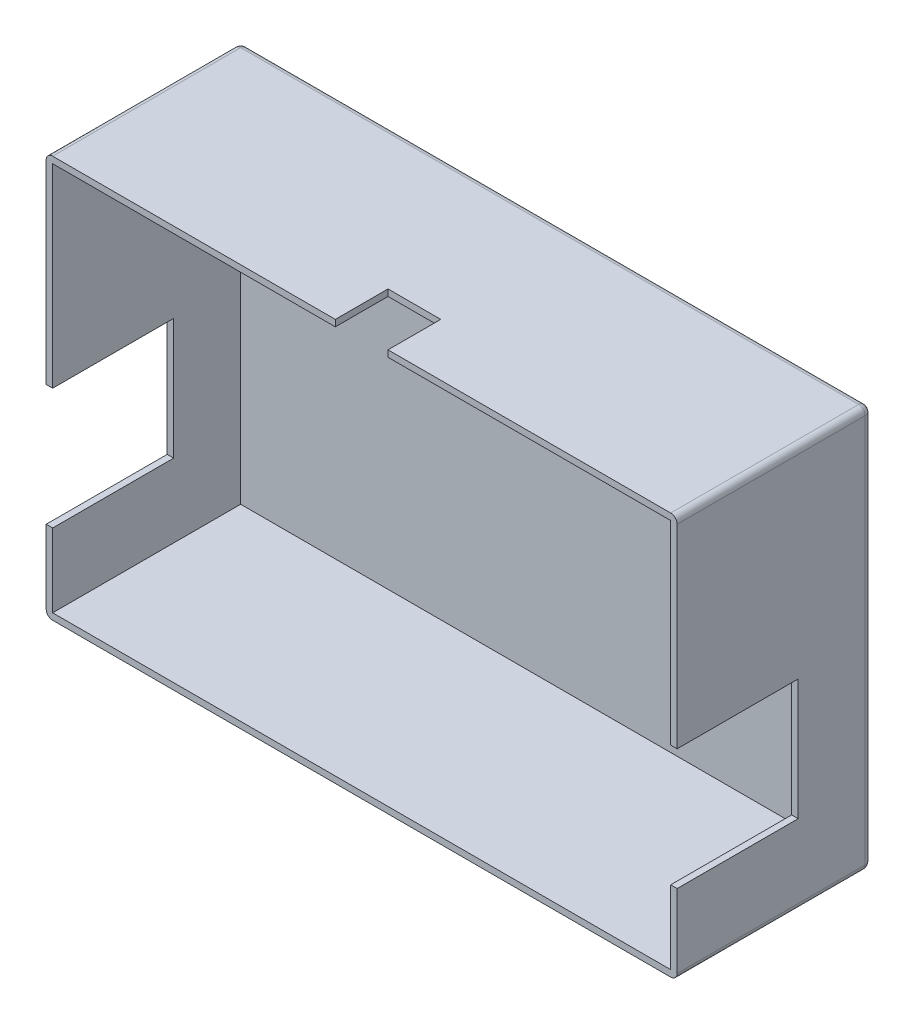
ISO-10303-21;
HEADER;
FILE_DESCRIPTION(('STEP AP214'),'2;1');
FILE_NAME('part.step','',(''),(''),'','','');
FILE_SCHEMA(('AUTOMOTIVE_DESIGN { 1 0 10303 214 1 1 1 1 }'));
ENDSEC;
DATA;
#1=APPLICATION_CONTEXT('core data for automotive mechanical design processes');
#2=APPLICATION_PROTOCOL_DEFINITION('international standard','automotive_design',2000,#1);
#3=PRODUCT_CONTEXT('',#1,'mechanical');
#4=PRODUCT('Part','Part','',(#3));
#5=PRODUCT_RELATED_PRODUCT_CATEGORY('part','',(#4));
#6=PRODUCT_DEFINITION_FORMATION('','',#4);
#7=PRODUCT_DEFINITION_CONTEXT('part definition',#1,'design');
#8=PRODUCT_DEFINITION('design','',#6,#7);
#9=PRODUCT_DEFINITION_SHAPE('','',#8);
#10=(LENGTH_UNIT() NAMED_UNIT(*) SI_UNIT(.MILLI.,.METRE.));
#11=(NAMED_UNIT(*) PLANE_ANGLE_UNIT() SI_UNIT($,.RADIAN.));
#12=(NAMED_UNIT(*) SI_UNIT($,.STERADIAN.) SOLID_ANGLE_UNIT());
#13=UNCERTAINTY_MEASURE_WITH_UNIT(LENGTH_MEASURE(1.E-05),#10,'distance_accuracy_value','');
#14=(GEOMETRIC_REPRESENTATION_CONTEXT(3) GLOBAL_UNCERTAINTY_ASSIGNED_CONTEXT((#13)) GLOBAL_UNIT_ASSIGNED_CONTEXT((#10,
#11,#12)) REPRESENTATION_CONTEXT('',''));
#15=CARTESIAN_POINT('',(0.,0.,0.));
#16=DIRECTION('',(0.,0.,1.));
#17=DIRECTION('',(1.,0.,0.));
#18=AXIS2_PLACEMENT_3D('',#15,#16,#17);
#19=CARTESIAN_POINT('',(-73.,93.,22.5));
#20=DIRECTION('',(0.,0.,-1.));
#21=DIRECTION('',(-1.,0.,0.));
#22=AXIS2_PLACEMENT_3D('',#19,#20,#21);
#23=PLANE('',#22);
#24=DIRECTION('',(0.,-1.,0.));
#25=VECTOR('',#24,1.);
#26=CARTESIAN_POINT('',(73.,93.,22.5));
#27=LINE('',#26,#25);
#28=CARTESIAN_POINT('',(73.,91.5,22.5));
#29=VERTEX_POINT('',#28);
#30=CARTESIAN_POINT('',(73.,46.5,22.5));
#31=VERTEX_POINT('',#30);
#32=EDGE_CURVE('E268',#29,#31,#27,.T.);
#33=ORIENTED_EDGE('',*,*,#32,.F.);
#34=CARTESIAN_POINT('',(71.5,91.5,22.5));
#35=DIRECTION('',(0.,0.,-1.));
#36=DIRECTION('',(-1.,0.,0.));
#37=AXIS2_PLACEMENT_3D('',#34,#35,#36);
#38=CIRCLE('',#37,1.5);
#39=CARTESIAN_POINT('',(71.5,93.,22.5));
#40=VERTEX_POINT('',#39);
#41=EDGE_CURVE('E48',#29,#40,#38,.F.);
#42=ORIENTED_EDGE('',*,*,#41,.T.);
#43=DIRECTION('',(1.,0.,0.));
#44=VECTOR('',#43,1.);
#45=CARTESIAN_POINT('',(-73.,93.,22.5));
#46=LINE('',#45,#44);
#47=CARTESIAN_POINT('',(6.09999999999999,93.,22.5));
#48=VERTEX_POINT('',#47);
#49=EDGE_CURVE('E264',#48,#40,#46,.T.);
#50=ORIENTED_EDGE('',*,*,#49,.F.);
#51=DIRECTION('',(0.,1.,0.));
#52=VECTOR('',#51,1.);
#53=CARTESIAN_POINT('',(6.09999999999999,91.5,22.5));
#54=LINE('',#53,#52);
#55=CARTESIAN_POINT('',(6.09999999999999,91.5,22.5));
#56=VERTEX_POINT('',#55);
#57=EDGE_CURVE('E380',#56,#48,#54,.T.);
#58=ORIENTED_EDGE('',*,*,#57,.F.);
#59=DIRECTION('',(1.,0.,0.));
#60=VECTOR('',#59,1.);
#61=CARTESIAN_POINT('',(0.,91.5,22.5));
#62=LINE('',#61,#60);
#63=CARTESIAN_POINT('',(71.5,91.5,22.5));
#64=VERTEX_POINT('',#63);
#65=EDGE_CURVE('E248',#56,#64,#62,.T.);
#66=ORIENTED_EDGE('',*,*,#65,.T.);
#67=DIRECTION('',(0.,-1.,0.));
#68=VECTOR('',#67,1.);
#69=CARTESIAN_POINT('',(71.5,93.,22.5));
#70=LINE('',#69,#68);
#71=CARTESIAN_POINT('',(71.5,46.5,22.5));
#72=VERTEX_POINT('',#71);
#73=EDGE_CURVE('E242',#64,#72,#70,.T.);
#74=ORIENTED_EDGE('',*,*,#73,.T.);
#75=DIRECTION('',(1.,0.,0.));
#76=VECTOR('',#75,1.);
#77=CARTESIAN_POINT('',(71.5,46.5,22.5));
#78=LINE('',#77,#76);
#79=EDGE_CURVE('E355',#72,#31,#78,.T.);
#80=ORIENTED_EDGE('',*,*,#79,.T.);
#81=EDGE_LOOP('',(#33,#42,#50,#58,#66,#74,#80));
#82=FACE_BOUND('',#81,.T.);
#83=ADVANCED_FACE('F39',(#82),#23,.F.);
#84=DIRECTION('',(1.,0.,0.));
#85=VECTOR('',#84,1.);
#86=CARTESIAN_POINT('',(-73.,0.,22.5));
#87=LINE('',#86,#85);
#88=CARTESIAN_POINT('',(-71.5,0.,22.5));
#89=VERTEX_POINT('',#88);
#90=CARTESIAN_POINT('',(71.5,0.,22.5));
#91=VERTEX_POINT('',#90);
#92=EDGE_CURVE('E265',#89,#91,#87,.T.);
#93=ORIENTED_EDGE('',*,*,#92,.T.);
#94=CARTESIAN_POINT('',(71.5,1.5,22.5));
#95=DIRECTION('',(0.,0.,-1.));
#96=DIRECTION('',(-1.,0.,0.));
#97=AXIS2_PLACEMENT_3D('',#94,#95,#96);
#98=CIRCLE('',#97,1.5);
#99=CARTESIAN_POINT('',(73.,1.50000000000003,22.5));
#100=VERTEX_POINT('',#99);
#101=EDGE_CURVE('E307',#91,#100,#98,.F.);
#102=ORIENTED_EDGE('',*,*,#101,.T.);
#103=CARTESIAN_POINT('',(73.,18.5,22.5));
#104=VERTEX_POINT('',#103);
#105=EDGE_CURVE('E234',#104,#100,#27,.T.);
#106=ORIENTED_EDGE('',*,*,#105,.F.);
#107=DIRECTION('',(1.,0.,0.));
#108=VECTOR('',#107,1.);
#109=CARTESIAN_POINT('',(71.5,18.5,22.5));
#110=LINE('',#109,#108);
#111=CARTESIAN_POINT('',(71.5,18.5,22.5));
#112=VERTEX_POINT('',#111);
#113=EDGE_CURVE('E216',#112,#104,#110,.T.);
#114=ORIENTED_EDGE('',*,*,#113,.F.);
#115=CARTESIAN_POINT('',(71.5,1.5,22.5));
#116=VERTEX_POINT('',#115);
#117=EDGE_CURVE('E231',#112,#116,#70,.T.);
#118=ORIENTED_EDGE('',*,*,#117,.T.);
#119=DIRECTION('',(1.,0.,0.));
#120=VECTOR('',#119,1.);
#121=CARTESIAN_POINT('',(0.,1.5,22.5));
#122=LINE('',#121,#120);
#123=CARTESIAN_POINT('',(-71.5,1.5,22.5));
#124=VERTEX_POINT('',#123);
#125=EDGE_CURVE('E258',#124,#116,#122,.T.);
#126=ORIENTED_EDGE('',*,*,#125,.F.);
#127=DIRECTION('',(0.,-1.,0.));
#128=VECTOR('',#127,1.);
#129=CARTESIAN_POINT('',(-71.5,93.,22.5));
#130=LINE('',#129,#128);
#131=CARTESIAN_POINT('',(-71.5,18.5,22.5));
#132=VERTEX_POINT('',#131);
#133=EDGE_CURVE('E246',#132,#124,#130,.T.);
#134=ORIENTED_EDGE('',*,*,#133,.F.);
#135=DIRECTION('',(-1.,0.,0.));
#136=VECTOR('',#135,1.);
#137=CARTESIAN_POINT('',(-71.5,18.5,22.5));
#138=LINE('',#137,#136);
#139=CARTESIAN_POINT('',(-73.,18.5,22.5));
#140=VERTEX_POINT('',#139);
#141=EDGE_CURVE('E406',#132,#140,#138,.T.);
#142=ORIENTED_EDGE('',*,*,#141,.T.);
#143=DIRECTION('',(0.,-1.,0.));
#144=VECTOR('',#143,1.);
#145=CARTESIAN_POINT('',(-73.,93.,22.5));
#146=LINE('',#145,#144);
#147=CARTESIAN_POINT('',(-73.,1.50000000000003,22.5));
#148=VERTEX_POINT('',#147);
#149=EDGE_CURVE('E270',#140,#148,#146,.T.);
#150=ORIENTED_EDGE('',*,*,#149,.T.);
#151=CARTESIAN_POINT('',(-71.5,1.5,22.5));
#152=DIRECTION('',(0.,0.,-1.));
#153=DIRECTION('',(-1.,0.,0.));
#154=AXIS2_PLACEMENT_3D('',#151,#152,#153);
#155=CIRCLE('',#154,1.5);
#156=EDGE_CURVE('E305',#148,#89,#155,.F.);
#157=ORIENTED_EDGE('',*,*,#156,.T.);
#158=EDGE_LOOP('',(#93,#102,#106,#114,#118,#126,#134,#142,#150,#157));
#159=FACE_BOUND('',#158,.T.);
#160=ADVANCED_FACE('F229',(#159),#23,.F.);
#161=CARTESIAN_POINT('',(73.,93.,22.5));
#162=DIRECTION('',(-1.,0.,0.));
#163=DIRECTION('',(0.,0.,1.));
#164=AXIS2_PLACEMENT_3D('',#161,#162,#163);
#165=PLANE('',#164);
#166=ORIENTED_EDGE('',*,*,#105,.T.);
#167=DIRECTION('',(0.,0.,-1.));
#168=VECTOR('',#167,1.);
#169=CARTESIAN_POINT('',(73.,1.5,-22.5));
#170=LINE('',#169,#168);
#171=CARTESIAN_POINT('',(73.,1.5,-21.));
#172=VERTEX_POINT('',#171);
#173=EDGE_CURVE('E287',#100,#172,#170,.T.);
#174=ORIENTED_EDGE('',*,*,#173,.T.);
#175=DIRECTION('',(0.,-1.,0.));
#176=VECTOR('',#175,1.);
#177=CARTESIAN_POINT('',(73.,93.,-21.));
#178=LINE('',#177,#176);
#179=CARTESIAN_POINT('',(73.,91.5,-21.));
#180=VERTEX_POINT('',#179);
#181=EDGE_CURVE('E284',#172,#180,#178,.F.);
#182=ORIENTED_EDGE('',*,*,#181,.T.);
#183=DIRECTION('',(0.,0.,-1.));
#184=VECTOR('',#183,1.);
#185=CARTESIAN_POINT('',(73.,91.5,22.5));
#186=LINE('',#185,#184);
#187=EDGE_CURVE('E282',#180,#29,#186,.F.);
#188=ORIENTED_EDGE('',*,*,#187,.T.);
#189=ORIENTED_EDGE('',*,*,#32,.T.);
#190=DIRECTION('',(0.,0.,-1.));
#191=VECTOR('',#190,1.);
#192=CARTESIAN_POINT('',(73.,46.5,22.5));
#193=LINE('',#192,#191);
#194=CARTESIAN_POINT('',(73.,46.5,-5.5));
#195=VERTEX_POINT('',#194);
#196=EDGE_CURVE('E224',#31,#195,#193,.T.);
#197=ORIENTED_EDGE('',*,*,#196,.T.);
#198=DIRECTION('',(0.,-1.,0.));
#199=VECTOR('',#198,1.);
#200=CARTESIAN_POINT('',(73.,46.5,-5.5));
#201=LINE('',#200,#199);
#202=CARTESIAN_POINT('',(73.,18.5,-5.5));
#203=VERTEX_POINT('',#202);
#204=EDGE_CURVE('E345',#195,#203,#201,.T.);
#205=ORIENTED_EDGE('',*,*,#204,.T.);
#206=DIRECTION('',(0.,0.,1.));
#207=VECTOR('',#206,1.);
#208=CARTESIAN_POINT('',(73.,18.5,-5.5));
#209=LINE('',#208,#207);
#210=EDGE_CURVE('E343',#203,#104,#209,.T.);
#211=ORIENTED_EDGE('',*,*,#210,.T.);
#212=EDGE_LOOP('',(#166,#174,#182,#188,#189,#197,#205,#211));
#213=FACE_BOUND('',#212,.T.);
#214=ADVANCED_FACE('F467',(#213),#165,.F.);
#215=CARTESIAN_POINT('',(71.5,93.,22.5));
#216=DIRECTION('',(-1.,0.,0.));
#217=DIRECTION('',(0.,0.,1.));
#218=AXIS2_PLACEMENT_3D('',#215,#216,#217);
#219=PLANE('',#218);
#220=DIRECTION('',(0.,-1.,0.));
#221=VECTOR('',#220,1.);
#222=CARTESIAN_POINT('',(71.5,46.5,-5.5));
#223=LINE('',#222,#221);
#224=CARTESIAN_POINT('',(71.5,46.5,-5.5));
#225=VERTEX_POINT('',#224);
#226=CARTESIAN_POINT('',(71.5,18.5,-5.5));
#227=VERTEX_POINT('',#226);
#228=EDGE_CURVE('E223',#225,#227,#223,.T.);
#229=ORIENTED_EDGE('',*,*,#228,.F.);
#230=DIRECTION('',(0.,0.,-1.));
#231=VECTOR('',#230,1.);
#232=CARTESIAN_POINT('',(71.5,46.5,22.5));
#233=LINE('',#232,#231);
#234=EDGE_CURVE('E235',#72,#225,#233,.T.);
#235=ORIENTED_EDGE('',*,*,#234,.F.);
#236=ORIENTED_EDGE('',*,*,#73,.F.);
#237=DIRECTION('',(0.,0.,-1.));
#238=VECTOR('',#237,1.);
#239=CARTESIAN_POINT('',(71.5,91.5,0.));
#240=LINE('',#239,#238);
#241=CARTESIAN_POINT('',(71.5,91.5,-21.));
#242=VERTEX_POINT('',#241);
#243=EDGE_CURVE('E260',#64,#242,#240,.T.);
#244=ORIENTED_EDGE('',*,*,#243,.T.);
#245=DIRECTION('',(0.,-1.,0.));
#246=VECTOR('',#245,1.);
#247=CARTESIAN_POINT('',(71.5,93.,-21.));
#248=LINE('',#247,#246);
#249=CARTESIAN_POINT('',(71.5,1.5,-21.));
#250=VERTEX_POINT('',#249);
#251=EDGE_CURVE('E267',#242,#250,#248,.T.);
#252=ORIENTED_EDGE('',*,*,#251,.T.);
#253=DIRECTION('',(0.,0.,-1.));
#254=VECTOR('',#253,1.);
#255=CARTESIAN_POINT('',(71.5,1.5,0.));
#256=LINE('',#255,#254);
#257=EDGE_CURVE('E241',#116,#250,#256,.T.);
#258=ORIENTED_EDGE('',*,*,#257,.F.);
#259=ORIENTED_EDGE('',*,*,#117,.F.);
#260=DIRECTION('',(0.,0.,1.));
#261=VECTOR('',#260,1.);
#262=CARTESIAN_POINT('',(71.5,18.5,-5.5));
#263=LINE('',#262,#261);
#264=EDGE_CURVE('E212',#227,#112,#263,.T.);
#265=ORIENTED_EDGE('',*,*,#264,.F.);
#266=EDGE_LOOP('',(#229,#235,#236,#244,#252,#258,#259,#265));
#267=FACE_BOUND('',#266,.T.);
#268=ADVANCED_FACE('F238',(#267),#219,.T.);
#269=CARTESIAN_POINT('',(-71.5,93.,22.5));
#270=VERTEX_POINT('',#269);
#271=CARTESIAN_POINT('',(-6.10000000000001,93.,22.5));
#272=VERTEX_POINT('',#271);
#273=EDGE_CURVE('E262',#270,#272,#46,.T.);
#274=ORIENTED_EDGE('',*,*,#273,.F.);
#275=CARTESIAN_POINT('',(-71.5,91.5,22.5));
#276=DIRECTION('',(0.,0.,-1.));
#277=DIRECTION('',(-1.,0.,0.));
#278=AXIS2_PLACEMENT_3D('',#275,#276,#277);
#279=CIRCLE('',#278,1.5);
#280=CARTESIAN_POINT('',(-73.,91.5,22.5));
#281=VERTEX_POINT('',#280);
#282=EDGE_CURVE('E11',#270,#281,#279,.F.);
#283=ORIENTED_EDGE('',*,*,#282,.T.);
#284=CARTESIAN_POINT('',(-73.,46.5,22.5));
#285=VERTEX_POINT('',#284);
#286=EDGE_CURVE('E271',#281,#285,#146,.T.);
#287=ORIENTED_EDGE('',*,*,#286,.T.);
#288=DIRECTION('',(-1.,0.,0.));
#289=VECTOR('',#288,1.);
#290=CARTESIAN_POINT('',(-71.5,46.5,22.5));
#291=LINE('',#290,#289);
#292=CARTESIAN_POINT('',(-71.5,46.5,22.5));
#293=VERTEX_POINT('',#292);
#294=EDGE_CURVE('E399',#293,#285,#291,.T.);
#295=ORIENTED_EDGE('',*,*,#294,.F.);
#296=CARTESIAN_POINT('',(-71.5,91.5,22.5));
#297=VERTEX_POINT('',#296);
#298=EDGE_CURVE('E254',#297,#293,#130,.T.);
#299=ORIENTED_EDGE('',*,*,#298,.F.);
#300=CARTESIAN_POINT('',(-6.10000000000001,91.5,22.5));
#301=VERTEX_POINT('',#300);
#302=EDGE_CURVE('E243',#297,#301,#62,.T.);
#303=ORIENTED_EDGE('',*,*,#302,.T.);
#304=DIRECTION('',(0.,1.,0.));
#305=VECTOR('',#304,1.);
#306=CARTESIAN_POINT('',(-6.10000000000001,91.5,22.5));
#307=LINE('',#306,#305);
#308=EDGE_CURVE('E383',#301,#272,#307,.T.);
#309=ORIENTED_EDGE('',*,*,#308,.T.);
#310=EDGE_LOOP('',(#274,#283,#287,#295,#299,#303,#309));
#311=FACE_BOUND('',#310,.T.);
#312=ADVANCED_FACE('F500',(#311),#23,.F.);
#313=CARTESIAN_POINT('',(-73.,93.,-22.5));
#314=DIRECTION('',(0.,0.,1.));
#315=DIRECTION('',(1.,0.,0.));
#316=AXIS2_PLACEMENT_3D('',#313,#314,#315);
#317=PLANE('',#316);
#318=DIRECTION('',(-1.,0.,0.));
#319=VECTOR('',#318,1.);
#320=CARTESIAN_POINT('',(-73.,91.5,-22.5));
#321=LINE('',#320,#319);
#322=CARTESIAN_POINT('',(-71.5,91.5,-22.5));
#323=VERTEX_POINT('',#322);
#324=CARTESIAN_POINT('',(71.5,91.5,-22.5));
#325=VERTEX_POINT('',#324);
#326=EDGE_CURVE('E277',#323,#325,#321,.F.);
#327=ORIENTED_EDGE('',*,*,#326,.T.);
#328=DIRECTION('',(0.,-1.,0.));
#329=VECTOR('',#328,1.);
#330=CARTESIAN_POINT('',(71.5,93.,-22.5));
#331=LINE('',#330,#329);
#332=CARTESIAN_POINT('',(71.5,1.5,-22.5));
#333=VERTEX_POINT('',#332);
#334=EDGE_CURVE('E279',#325,#333,#331,.T.);
#335=ORIENTED_EDGE('',*,*,#334,.T.);
#336=DIRECTION('',(-1.,0.,0.));
#337=VECTOR('',#336,1.);
#338=CARTESIAN_POINT('',(-73.,1.5,-22.5));
#339=LINE('',#338,#337);
#340=CARTESIAN_POINT('',(-71.5,1.5,-22.5));
#341=VERTEX_POINT('',#340);
#342=EDGE_CURVE('E273',#333,#341,#339,.T.);
#343=ORIENTED_EDGE('',*,*,#342,.T.);
#344=DIRECTION('',(0.,-1.,0.));
#345=VECTOR('',#344,1.);
#346=CARTESIAN_POINT('',(-71.5,93.,-22.5));
#347=LINE('',#346,#345);
#348=EDGE_CURVE('E275',#341,#323,#347,.F.);
#349=ORIENTED_EDGE('',*,*,#348,.T.);
#350=EDGE_LOOP('',(#327,#335,#343,#349));
#351=FACE_BOUND('',#350,.T.);
#352=ADVANCED_FACE('F507',(#351),#317,.F.);
#353=CARTESIAN_POINT('',(-73.,93.,22.5));
#354=DIRECTION('',(1.,0.,0.));
#355=DIRECTION('',(0.,0.,-1.));
#356=AXIS2_PLACEMENT_3D('',#353,#354,#355);
#357=PLANE('',#356);
#358=DIRECTION('',(0.,-1.,0.));
#359=VECTOR('',#358,1.);
#360=CARTESIAN_POINT('',(-73.,93.,-21.));
#361=LINE('',#360,#359);
#362=CARTESIAN_POINT('',(-73.,91.5,-21.));
#363=VERTEX_POINT('',#362);
#364=CARTESIAN_POINT('',(-73.,1.5,-21.));
#365=VERTEX_POINT('',#364);
#366=EDGE_CURVE('E297',#363,#365,#361,.T.);
#367=ORIENTED_EDGE('',*,*,#366,.T.);
#368=DIRECTION('',(0.,0.,1.));
#369=VECTOR('',#368,1.);
#370=CARTESIAN_POINT('',(-73.,1.5,22.5));
#371=LINE('',#370,#369);
#372=EDGE_CURVE('E299',#365,#148,#371,.T.);
#373=ORIENTED_EDGE('',*,*,#372,.T.);
#374=ORIENTED_EDGE('',*,*,#149,.F.);
#375=DIRECTION('',(0.,0.,1.));
#376=VECTOR('',#375,1.);
#377=CARTESIAN_POINT('',(-73.,18.5,-5.5));
#378=LINE('',#377,#376);
#379=CARTESIAN_POINT('',(-73.,18.5,-5.5));
#380=VERTEX_POINT('',#379);
#381=EDGE_CURVE('E393',#380,#140,#378,.T.);
#382=ORIENTED_EDGE('',*,*,#381,.F.);
#383=DIRECTION('',(0.,-1.,0.));
#384=VECTOR('',#383,1.);
#385=CARTESIAN_POINT('',(-73.,46.5,-5.5));
#386=LINE('',#385,#384);
#387=CARTESIAN_POINT('',(-73.,46.5,-5.5));
#388=VERTEX_POINT('',#387);
#389=EDGE_CURVE('E402',#388,#380,#386,.T.);
#390=ORIENTED_EDGE('',*,*,#389,.F.);
#391=DIRECTION('',(0.,0.,-1.));
#392=VECTOR('',#391,1.);
#393=CARTESIAN_POINT('',(-73.,46.5,22.5));
#394=LINE('',#393,#392);
#395=EDGE_CURVE('E382',#285,#388,#394,.T.);
#396=ORIENTED_EDGE('',*,*,#395,.F.);
#397=ORIENTED_EDGE('',*,*,#286,.F.);
#398=DIRECTION('',(0.,0.,1.));
#399=VECTOR('',#398,1.);
#400=CARTESIAN_POINT('',(-73.,91.5,22.5));
#401=LINE('',#400,#399);
#402=EDGE_CURVE('E295',#281,#363,#401,.F.);
#403=ORIENTED_EDGE('',*,*,#402,.T.);
#404=EDGE_LOOP('',(#367,#373,#374,#382,#390,#396,#397,#403));
#405=FACE_BOUND('',#404,.T.);
#406=ADVANCED_FACE('F440',(#405),#357,.F.);
#407=CARTESIAN_POINT('',(0.,93.,0.));
#408=DIRECTION('',(0.,-1.,0.));
#409=DIRECTION('',(0.,0.,-1.));
#410=AXIS2_PLACEMENT_3D('',#407,#408,#409);
#411=PLANE('',#410);
#412=ORIENTED_EDGE('',*,*,#49,.T.);
#413=DIRECTION('',(0.,0.,-1.));
#414=VECTOR('',#413,1.);
#415=CARTESIAN_POINT('',(71.5,93.,0.));
#416=LINE('',#415,#414);
#417=CARTESIAN_POINT('',(71.5,93.,-21.));
#418=VERTEX_POINT('',#417);
#419=EDGE_CURVE('E293',#40,#418,#416,.T.);
#420=ORIENTED_EDGE('',*,*,#419,.T.);
#421=DIRECTION('',(-1.,0.,0.));
#422=VECTOR('',#421,1.);
#423=CARTESIAN_POINT('',(0.,93.,-21.));
#424=LINE('',#423,#422);
#425=CARTESIAN_POINT('',(-71.5,93.,-21.));
#426=VERTEX_POINT('',#425);
#427=EDGE_CURVE('E291',#418,#426,#424,.T.);
#428=ORIENTED_EDGE('',*,*,#427,.T.);
#429=DIRECTION('',(0.,0.,1.));
#430=VECTOR('',#429,1.);
#431=CARTESIAN_POINT('',(-71.5,93.,0.));
#432=LINE('',#431,#430);
#433=EDGE_CURVE('E289',#426,#270,#432,.T.);
#434=ORIENTED_EDGE('',*,*,#433,.T.);
#435=ORIENTED_EDGE('',*,*,#273,.T.);
#436=DIRECTION('',(0.,0.,1.));
#437=VECTOR('',#436,1.);
#438=CARTESIAN_POINT('',(-6.10000000000001,93.,22.5));
#439=LINE('',#438,#437);
#440=CARTESIAN_POINT('',(-6.1,93.,10.3));
#441=VERTEX_POINT('',#440);
#442=EDGE_CURVE('E366',#441,#272,#439,.T.);
#443=ORIENTED_EDGE('',*,*,#442,.F.);
#444=DIRECTION('',(-1.,0.,0.));
#445=VECTOR('',#444,1.);
#446=CARTESIAN_POINT('',(-6.1,93.,10.3));
#447=LINE('',#446,#445);
#448=CARTESIAN_POINT('',(6.1,93.,10.3));
#449=VERTEX_POINT('',#448);
#450=EDGE_CURVE('E375',#449,#441,#447,.T.);
#451=ORIENTED_EDGE('',*,*,#450,.F.);
#452=DIRECTION('',(0.,0.,-1.));
#453=VECTOR('',#452,1.);
#454=CARTESIAN_POINT('',(6.1,93.,10.3));
#455=LINE('',#454,#453);
#456=EDGE_CURVE('E358',#48,#449,#455,.T.);
#457=ORIENTED_EDGE('',*,*,#456,.F.);
#458=EDGE_LOOP('',(#412,#420,#428,#434,#435,#443,#451,#457));
#459=FACE_BOUND('',#458,.T.);
#460=ADVANCED_FACE('F481',(#459),#411,.F.);
#461=CARTESIAN_POINT('',(0.,0.,0.));
#462=DIRECTION('',(0.,-1.,0.));
#463=DIRECTION('',(0.,0.,-1.));
#464=AXIS2_PLACEMENT_3D('',#461,#462,#463);
#465=PLANE('',#464);
#466=DIRECTION('',(-1.,0.,0.));
#467=VECTOR('',#466,1.);
#468=CARTESIAN_POINT('',(73.,0.,-21.));
#469=LINE('',#468,#467);
#470=CARTESIAN_POINT('',(-71.5,0.,-21.));
#471=VERTEX_POINT('',#470);
#472=CARTESIAN_POINT('',(71.5,0.,-21.));
#473=VERTEX_POINT('',#472);
#474=EDGE_CURVE('E56',#471,#473,#469,.F.);
#475=ORIENTED_EDGE('',*,*,#474,.T.);
#476=DIRECTION('',(0.,0.,-1.));
#477=VECTOR('',#476,1.);
#478=CARTESIAN_POINT('',(71.5,0.,22.5));
#479=LINE('',#478,#477);
#480=EDGE_CURVE('E303',#473,#91,#479,.F.);
#481=ORIENTED_EDGE('',*,*,#480,.T.);
#482=ORIENTED_EDGE('',*,*,#92,.F.);
#483=DIRECTION('',(0.,0.,1.));
#484=VECTOR('',#483,1.);
#485=CARTESIAN_POINT('',(-71.5,0.,-22.5));
#486=LINE('',#485,#484);
#487=EDGE_CURVE('E61',#89,#471,#486,.F.);
#488=ORIENTED_EDGE('',*,*,#487,.T.);
#489=EDGE_LOOP('',(#475,#481,#482,#488));
#490=FACE_BOUND('',#489,.T.);
#491=ADVANCED_FACE('F567',(#490),#465,.T.);
#492=CARTESIAN_POINT('',(-73.,93.,-21.));
#493=DIRECTION('',(0.,0.,1.));
#494=DIRECTION('',(1.,0.,0.));
#495=AXIS2_PLACEMENT_3D('',#492,#493,#494);
#496=PLANE('',#495);
#497=DIRECTION('',(-1.,0.,0.));
#498=VECTOR('',#497,1.);
#499=CARTESIAN_POINT('',(0.,1.5,-21.));
#500=LINE('',#499,#498);
#501=CARTESIAN_POINT('',(-71.5,1.5,-21.));
#502=VERTEX_POINT('',#501);
#503=EDGE_CURVE('E416',#250,#502,#500,.T.);
#504=ORIENTED_EDGE('',*,*,#503,.F.);
#505=ORIENTED_EDGE('',*,*,#251,.F.);
#506=DIRECTION('',(-1.,0.,0.));
#507=VECTOR('',#506,1.);
#508=CARTESIAN_POINT('',(0.,91.5,-21.));
#509=LINE('',#508,#507);
#510=CARTESIAN_POINT('',(-71.5,91.5,-21.));
#511=VERTEX_POINT('',#510);
#512=EDGE_CURVE('E420',#242,#511,#509,.T.);
#513=ORIENTED_EDGE('',*,*,#512,.T.);
#514=DIRECTION('',(0.,-1.,0.));
#515=VECTOR('',#514,1.);
#516=CARTESIAN_POINT('',(-71.5,93.,-21.));
#517=LINE('',#516,#515);
#518=EDGE_CURVE('E257',#511,#502,#517,.T.);
#519=ORIENTED_EDGE('',*,*,#518,.T.);
#520=EDGE_LOOP('',(#504,#505,#513,#519));
#521=FACE_BOUND('',#520,.T.);
#522=ADVANCED_FACE('F564',(#521),#496,.T.);
#523=CARTESIAN_POINT('',(-71.5,93.,22.5));
#524=DIRECTION('',(1.,0.,0.));
#525=DIRECTION('',(0.,0.,-1.));
#526=AXIS2_PLACEMENT_3D('',#523,#524,#525);
#527=PLANE('',#526);
#528=DIRECTION('',(0.,0.,1.));
#529=VECTOR('',#528,1.);
#530=CARTESIAN_POINT('',(-71.5,18.5,-5.5));
#531=LINE('',#530,#529);
#532=CARTESIAN_POINT('',(-71.5,18.5,-5.5));
#533=VERTEX_POINT('',#532);
#534=EDGE_CURVE('E396',#533,#132,#531,.T.);
#535=ORIENTED_EDGE('',*,*,#534,.T.);
#536=ORIENTED_EDGE('',*,*,#133,.T.);
#537=DIRECTION('',(0.,0.,1.));
#538=VECTOR('',#537,1.);
#539=CARTESIAN_POINT('',(-71.5,1.5,0.));
#540=LINE('',#539,#538);
#541=EDGE_CURVE('E261',#502,#124,#540,.T.);
#542=ORIENTED_EDGE('',*,*,#541,.F.);
#543=ORIENTED_EDGE('',*,*,#518,.F.);
#544=DIRECTION('',(0.,0.,1.));
#545=VECTOR('',#544,1.);
#546=CARTESIAN_POINT('',(-71.5,91.5,0.));
#547=LINE('',#546,#545);
#548=EDGE_CURVE('E251',#511,#297,#547,.T.);
#549=ORIENTED_EDGE('',*,*,#548,.T.);
#550=ORIENTED_EDGE('',*,*,#298,.T.);
#551=DIRECTION('',(0.,0.,-1.));
#552=VECTOR('',#551,1.);
#553=CARTESIAN_POINT('',(-71.5,46.5,22.5));
#554=LINE('',#553,#552);
#555=CARTESIAN_POINT('',(-71.5,46.5,-5.5));
#556=VERTEX_POINT('',#555);
#557=EDGE_CURVE('E389',#293,#556,#554,.T.);
#558=ORIENTED_EDGE('',*,*,#557,.T.);
#559=DIRECTION('',(0.,-1.,0.));
#560=VECTOR('',#559,1.);
#561=CARTESIAN_POINT('',(-71.5,46.5,-5.5));
#562=LINE('',#561,#560);
#563=EDGE_CURVE('E392',#556,#533,#562,.T.);
#564=ORIENTED_EDGE('',*,*,#563,.T.);
#565=EDGE_LOOP('',(#535,#536,#542,#543,#549,#550,#558,#564));
#566=FACE_BOUND('',#565,.T.);
#567=ADVANCED_FACE('F433',(#566),#527,.T.);
#568=CARTESIAN_POINT('',(0.,91.5,0.));
#569=DIRECTION('',(0.,-1.,0.));
#570=DIRECTION('',(0.,0.,-1.));
#571=AXIS2_PLACEMENT_3D('',#568,#569,#570);
#572=PLANE('',#571);
#573=DIRECTION('',(0.,0.,-1.));
#574=VECTOR('',#573,1.);
#575=CARTESIAN_POINT('',(6.1,91.5,10.3));
#576=LINE('',#575,#574);
#577=CARTESIAN_POINT('',(6.1,91.5,10.3));
#578=VERTEX_POINT('',#577);
#579=EDGE_CURVE('E362',#56,#578,#576,.T.);
#580=ORIENTED_EDGE('',*,*,#579,.T.);
#581=DIRECTION('',(-1.,0.,0.));
#582=VECTOR('',#581,1.);
#583=CARTESIAN_POINT('',(-6.1,91.5,10.3));
#584=LINE('',#583,#582);
#585=CARTESIAN_POINT('',(-6.1,91.5,10.3));
#586=VERTEX_POINT('',#585);
#587=EDGE_CURVE('E365',#578,#586,#584,.T.);
#588=ORIENTED_EDGE('',*,*,#587,.T.);
#589=DIRECTION('',(0.,0.,1.));
#590=VECTOR('',#589,1.);
#591=CARTESIAN_POINT('',(-6.10000000000001,91.5,22.5));
#592=LINE('',#591,#590);
#593=EDGE_CURVE('E369',#586,#301,#592,.T.);
#594=ORIENTED_EDGE('',*,*,#593,.T.);
#595=ORIENTED_EDGE('',*,*,#302,.F.);
#596=ORIENTED_EDGE('',*,*,#548,.F.);
#597=ORIENTED_EDGE('',*,*,#512,.F.);
#598=ORIENTED_EDGE('',*,*,#243,.F.);
#599=ORIENTED_EDGE('',*,*,#65,.F.);
#600=EDGE_LOOP('',(#580,#588,#594,#595,#596,#597,#598,#599));
#601=FACE_BOUND('',#600,.T.);
#602=ADVANCED_FACE('F571',(#601),#572,.T.);
#603=CARTESIAN_POINT('',(0.,1.5,0.));
#604=DIRECTION('',(0.,-1.,0.));
#605=DIRECTION('',(0.,0.,-1.));
#606=AXIS2_PLACEMENT_3D('',#603,#604,#605);
#607=PLANE('',#606);
#608=ORIENTED_EDGE('',*,*,#257,.T.);
#609=ORIENTED_EDGE('',*,*,#503,.T.);
#610=ORIENTED_EDGE('',*,*,#541,.T.);
#611=ORIENTED_EDGE('',*,*,#125,.T.);
#612=EDGE_LOOP('',(#608,#609,#610,#611));
#613=FACE_BOUND('',#612,.T.);
#614=ADVANCED_FACE('F427',(#613),#607,.F.);
#615=CARTESIAN_POINT('',(-71.5,18.5,-5.5));
#616=DIRECTION('',(0.,-1.,0.));
#617=DIRECTION('',(0.,0.,-1.));
#618=AXIS2_PLACEMENT_3D('',#615,#616,#617);
#619=PLANE('',#618);
#620=ORIENTED_EDGE('',*,*,#381,.T.);
#621=ORIENTED_EDGE('',*,*,#141,.F.);
#622=ORIENTED_EDGE('',*,*,#534,.F.);
#623=DIRECTION('',(-1.,0.,0.));
#624=VECTOR('',#623,1.);
#625=CARTESIAN_POINT('',(-71.5,18.5,-5.5));
#626=LINE('',#625,#624);
#627=EDGE_CURVE('E409',#533,#380,#626,.T.);
#628=ORIENTED_EDGE('',*,*,#627,.T.);
#629=EDGE_LOOP('',(#620,#621,#622,#628));
#630=FACE_BOUND('',#629,.T.);
#631=ADVANCED_FACE('F436',(#630),#619,.F.);
#632=CARTESIAN_POINT('',(-71.5,46.5,-5.5));
#633=DIRECTION('',(0.,0.,-1.));
#634=DIRECTION('',(0.,1.,0.));
#635=AXIS2_PLACEMENT_3D('',#632,#633,#634);
#636=PLANE('',#635);
#637=ORIENTED_EDGE('',*,*,#389,.T.);
#638=ORIENTED_EDGE('',*,*,#627,.F.);
#639=ORIENTED_EDGE('',*,*,#563,.F.);
#640=DIRECTION('',(-1.,0.,0.));
#641=VECTOR('',#640,1.);
#642=CARTESIAN_POINT('',(-71.5,46.5,-5.5));
#643=LINE('',#642,#641);
#644=EDGE_CURVE('E411',#556,#388,#643,.T.);
#645=ORIENTED_EDGE('',*,*,#644,.T.);
#646=EDGE_LOOP('',(#637,#638,#639,#645));
#647=FACE_BOUND('',#646,.T.);
#648=ADVANCED_FACE('F557',(#647),#636,.F.);
#649=CARTESIAN_POINT('',(-71.5,46.5,22.5));
#650=DIRECTION('',(0.,1.,0.));
#651=DIRECTION('',(0.,0.,1.));
#652=AXIS2_PLACEMENT_3D('',#649,#650,#651);
#653=PLANE('',#652);
#654=ORIENTED_EDGE('',*,*,#395,.T.);
#655=ORIENTED_EDGE('',*,*,#644,.F.);
#656=ORIENTED_EDGE('',*,*,#557,.F.);
#657=ORIENTED_EDGE('',*,*,#294,.T.);
#658=EDGE_LOOP('',(#654,#655,#656,#657));
#659=FACE_BOUND('',#658,.T.);
#660=ADVANCED_FACE('F553',(#659),#653,.F.);
#661=CARTESIAN_POINT('',(6.1,91.5,10.3));
#662=DIRECTION('',(1.,0.,0.));
#663=DIRECTION('',(0.,0.,-1.));
#664=AXIS2_PLACEMENT_3D('',#661,#662,#663);
#665=PLANE('',#664);
#666=ORIENTED_EDGE('',*,*,#456,.T.);
#667=DIRECTION('',(0.,1.,0.));
#668=VECTOR('',#667,1.);
#669=CARTESIAN_POINT('',(6.1,91.5,10.3));
#670=LINE('',#669,#668);
#671=EDGE_CURVE('E372',#578,#449,#670,.T.);
#672=ORIENTED_EDGE('',*,*,#671,.F.);
#673=ORIENTED_EDGE('',*,*,#579,.F.);
#674=ORIENTED_EDGE('',*,*,#57,.T.);
#675=EDGE_LOOP('',(#666,#672,#673,#674));
#676=FACE_BOUND('',#675,.T.);
#677=ADVANCED_FACE('F546',(#676),#665,.F.);
#678=CARTESIAN_POINT('',(-6.10000000000001,91.5,22.5));
#679=DIRECTION('',(-1.,0.,0.));
#680=DIRECTION('',(0.,0.,1.));
#681=AXIS2_PLACEMENT_3D('',#678,#679,#680);
#682=PLANE('',#681);
#683=ORIENTED_EDGE('',*,*,#442,.T.);
#684=ORIENTED_EDGE('',*,*,#308,.F.);
#685=ORIENTED_EDGE('',*,*,#593,.F.);
#686=DIRECTION('',(0.,1.,0.));
#687=VECTOR('',#686,1.);
#688=CARTESIAN_POINT('',(-6.1,91.5,10.3));
#689=LINE('',#688,#687);
#690=EDGE_CURVE('E386',#586,#441,#689,.T.);
#691=ORIENTED_EDGE('',*,*,#690,.T.);
#692=EDGE_LOOP('',(#683,#684,#685,#691));
#693=FACE_BOUND('',#692,.T.);
#694=ADVANCED_FACE('F542',(#693),#682,.F.);
#695=CARTESIAN_POINT('',(-6.1,91.5,10.3));
#696=DIRECTION('',(0.,0.,-1.));
#697=DIRECTION('',(-1.,0.,0.));
#698=AXIS2_PLACEMENT_3D('',#695,#696,#697);
#699=PLANE('',#698);
#700=ORIENTED_EDGE('',*,*,#450,.T.);
#701=ORIENTED_EDGE('',*,*,#690,.F.);
#702=ORIENTED_EDGE('',*,*,#587,.F.);
#703=ORIENTED_EDGE('',*,*,#671,.T.);
#704=EDGE_LOOP('',(#700,#701,#702,#703));
#705=FACE_BOUND('',#704,.T.);
#706=ADVANCED_FACE('F545',(#705),#699,.F.);
#707=CARTESIAN_POINT('',(71.5,46.5,22.5));
#708=DIRECTION('',(0.,-1.,0.));
#709=DIRECTION('',(0.,0.,-1.));
#710=AXIS2_PLACEMENT_3D('',#707,#708,#709);
#711=PLANE('',#710);
#712=ORIENTED_EDGE('',*,*,#196,.F.);
#713=ORIENTED_EDGE('',*,*,#79,.F.);
#714=ORIENTED_EDGE('',*,*,#234,.T.);
#715=DIRECTION('',(1.,0.,0.));
#716=VECTOR('',#715,1.);
#717=CARTESIAN_POINT('',(71.5,46.5,-5.5));
#718=LINE('',#717,#716);
#719=EDGE_CURVE('E359',#225,#195,#718,.T.);
#720=ORIENTED_EDGE('',*,*,#719,.T.);
#721=EDGE_LOOP('',(#712,#713,#714,#720));
#722=FACE_BOUND('',#721,.T.);
#723=ADVANCED_FACE('F537',(#722),#711,.T.);
#724=CARTESIAN_POINT('',(71.5,46.5,-5.5));
#725=DIRECTION('',(0.,0.,1.));
#726=DIRECTION('',(0.,-1.,0.));
#727=AXIS2_PLACEMENT_3D('',#724,#725,#726);
#728=PLANE('',#727);
#729=ORIENTED_EDGE('',*,*,#204,.F.);
#730=ORIENTED_EDGE('',*,*,#719,.F.);
#731=ORIENTED_EDGE('',*,*,#228,.T.);
#732=DIRECTION('',(1.,0.,0.));
#733=VECTOR('',#732,1.);
#734=CARTESIAN_POINT('',(71.5,18.5,-5.5));
#735=LINE('',#734,#733);
#736=EDGE_CURVE('E218',#227,#203,#735,.T.);
#737=ORIENTED_EDGE('',*,*,#736,.T.);
#738=EDGE_LOOP('',(#729,#730,#731,#737));
#739=FACE_BOUND('',#738,.T.);
#740=ADVANCED_FACE('F532',(#739),#728,.T.);
#741=CARTESIAN_POINT('',(71.5,18.5,-5.5));
#742=DIRECTION('',(0.,1.,0.));
#743=DIRECTION('',(0.,0.,1.));
#744=AXIS2_PLACEMENT_3D('',#741,#742,#743);
#745=PLANE('',#744);
#746=ORIENTED_EDGE('',*,*,#210,.F.);
#747=ORIENTED_EDGE('',*,*,#736,.F.);
#748=ORIENTED_EDGE('',*,*,#264,.T.);
#749=ORIENTED_EDGE('',*,*,#113,.T.);
#750=EDGE_LOOP('',(#746,#747,#748,#749));
#751=FACE_BOUND('',#750,.T.);
#752=ADVANCED_FACE('F215',(#751),#745,.T.);
#753=CARTESIAN_POINT('',(-71.5,91.5,0.));
#754=DIRECTION('',(0.,0.,1.));
#755=DIRECTION('',(1.,0.,0.));
#756=AXIS2_PLACEMENT_3D('',#753,#754,#755);
#757=CYLINDRICAL_SURFACE('',#756,1.5);
#758=ORIENTED_EDGE('',*,*,#282,.F.);
#759=ORIENTED_EDGE('',*,*,#433,.F.);
#760=CARTESIAN_POINT('',(-71.5,91.5,-21.));
#761=DIRECTION('',(0.,0.,-1.));
#762=DIRECTION('',(-1.,0.,0.));
#763=AXIS2_PLACEMENT_3D('',#760,#761,#762);
#764=CIRCLE('',#763,1.5);
#765=EDGE_CURVE('E43',#363,#426,#764,.T.);
#766=ORIENTED_EDGE('',*,*,#765,.F.);
#767=ORIENTED_EDGE('',*,*,#402,.F.);
#768=EDGE_LOOP('',(#758,#759,#766,#767));
#769=FACE_BOUND('',#768,.T.);
#770=ADVANCED_FACE('F41',(#769),#757,.T.);
#771=CARTESIAN_POINT('',(-71.5,93.,-21.));
#772=DIRECTION('',(0.,-1.,0.));
#773=DIRECTION('',(0.,0.,-1.));
#774=AXIS2_PLACEMENT_3D('',#771,#772,#773);
#775=CYLINDRICAL_SURFACE('',#774,1.5);
#776=CARTESIAN_POINT('',(-71.5,1.5,-21.));
#777=DIRECTION('',(0.,-1.,0.));
#778=DIRECTION('',(0.,0.,-1.));
#779=AXIS2_PLACEMENT_3D('',#776,#777,#778);
#780=CIRCLE('',#779,1.5);
#781=EDGE_CURVE('E335',#365,#341,#780,.T.);
#782=ORIENTED_EDGE('',*,*,#781,.F.);
#783=ORIENTED_EDGE('',*,*,#366,.F.);
#784=CARTESIAN_POINT('',(-71.5,91.5,-21.));
#785=DIRECTION('',(0.,1.,0.));
#786=DIRECTION('',(0.,0.,1.));
#787=AXIS2_PLACEMENT_3D('',#784,#785,#786);
#788=CIRCLE('',#787,1.5);
#789=EDGE_CURVE('E337',#323,#363,#788,.T.);
#790=ORIENTED_EDGE('',*,*,#789,.F.);
#791=ORIENTED_EDGE('',*,*,#348,.F.);
#792=EDGE_LOOP('',(#782,#783,#790,#791));
#793=FACE_BOUND('',#792,.T.);
#794=ADVANCED_FACE('F496',(#793),#775,.T.);
#795=CARTESIAN_POINT('',(-71.5,1.5,22.5));
#796=DIRECTION('',(0.,0.,-1.));
#797=DIRECTION('',(-1.,0.,0.));
#798=AXIS2_PLACEMENT_3D('',#795,#796,#797);
#799=CYLINDRICAL_SURFACE('',#798,1.5);
#800=ORIENTED_EDGE('',*,*,#156,.F.);
#801=ORIENTED_EDGE('',*,*,#372,.F.);
#802=CARTESIAN_POINT('',(-71.5,1.5,-21.));
#803=DIRECTION('',(0.,0.,-1.));
#804=DIRECTION('',(-1.,0.,0.));
#805=AXIS2_PLACEMENT_3D('',#802,#803,#804);
#806=CIRCLE('',#805,1.5);
#807=EDGE_CURVE('E332',#471,#365,#806,.T.);
#808=ORIENTED_EDGE('',*,*,#807,.F.);
#809=ORIENTED_EDGE('',*,*,#487,.F.);
#810=EDGE_LOOP('',(#800,#801,#808,#809));
#811=FACE_BOUND('',#810,.T.);
#812=ADVANCED_FACE('F445',(#811),#799,.T.);
#813=CARTESIAN_POINT('',(-71.5,91.5,-21.));
#814=DIRECTION('',(-1.,0.,0.));
#815=DIRECTION('',(0.,0.,1.));
#816=AXIS2_PLACEMENT_3D('',#813,#814,#815);
#817=SPHERICAL_SURFACE('',#816,1.5);
#818=ORIENTED_EDGE('',*,*,#789,.T.);
#819=ORIENTED_EDGE('',*,*,#765,.T.);
#820=CARTESIAN_POINT('',(-71.5,91.5,-21.));
#821=DIRECTION('',(-1.,0.,0.));
#822=DIRECTION('',(0.,0.,1.));
#823=AXIS2_PLACEMENT_3D('',#820,#821,#822);
#824=CIRCLE('',#823,1.5);
#825=EDGE_CURVE('E329',#323,#426,#824,.F.);
#826=ORIENTED_EDGE('',*,*,#825,.F.);
#827=EDGE_LOOP('',(#818,#819,#826));
#828=FACE_BOUND('',#827,.T.);
#829=ADVANCED_FACE('F488',(#828),#817,.T.);
#830=CARTESIAN_POINT('',(-71.5,1.5,-21.));
#831=DIRECTION('',(-1.,0.,0.));
#832=DIRECTION('',(0.,-1.,0.));
#833=AXIS2_PLACEMENT_3D('',#830,#831,#832);
#834=SPHERICAL_SURFACE('',#833,1.5);
#835=ORIENTED_EDGE('',*,*,#807,.T.);
#836=ORIENTED_EDGE('',*,*,#781,.T.);
#837=CARTESIAN_POINT('',(-71.5,1.5,-21.));
#838=DIRECTION('',(-1.,0.,0.));
#839=DIRECTION('',(0.,0.,1.));
#840=AXIS2_PLACEMENT_3D('',#837,#838,#839);
#841=CIRCLE('',#840,1.5);
#842=EDGE_CURVE('E326',#471,#341,#841,.F.);
#843=ORIENTED_EDGE('',*,*,#842,.F.);
#844=EDGE_LOOP('',(#835,#836,#843));
#845=FACE_BOUND('',#844,.T.);
#846=ADVANCED_FACE('F449',(#845),#834,.T.);
#847=CARTESIAN_POINT('',(71.5,91.5,0.));
#848=DIRECTION('',(0.,0.,-1.));
#849=DIRECTION('',(-1.,0.,0.));
#850=AXIS2_PLACEMENT_3D('',#847,#848,#849);
#851=CYLINDRICAL_SURFACE('',#850,1.5);
#852=ORIENTED_EDGE('',*,*,#41,.F.);
#853=ORIENTED_EDGE('',*,*,#187,.F.);
#854=CARTESIAN_POINT('',(71.5,91.5,-21.));
#855=DIRECTION('',(0.,0.,-1.));
#856=DIRECTION('',(-1.,0.,0.));
#857=AXIS2_PLACEMENT_3D('',#854,#855,#856);
#858=CIRCLE('',#857,1.5);
#859=EDGE_CURVE('E323',#418,#180,#858,.T.);
#860=ORIENTED_EDGE('',*,*,#859,.F.);
#861=ORIENTED_EDGE('',*,*,#419,.F.);
#862=EDGE_LOOP('',(#852,#853,#860,#861));
#863=FACE_BOUND('',#862,.T.);
#864=ADVANCED_FACE('F478',(#863),#851,.T.);
#865=CARTESIAN_POINT('',(0.,91.5,-21.));
#866=DIRECTION('',(-1.,0.,0.));
#867=DIRECTION('',(0.,0.,1.));
#868=AXIS2_PLACEMENT_3D('',#865,#866,#867);
#869=CYLINDRICAL_SURFACE('',#868,1.5);
#870=ORIENTED_EDGE('',*,*,#825,.T.);
#871=ORIENTED_EDGE('',*,*,#427,.F.);
#872=CARTESIAN_POINT('',(71.5,91.5,-21.));
#873=DIRECTION('',(1.,0.,0.));
#874=DIRECTION('',(0.,0.,-1.));
#875=AXIS2_PLACEMENT_3D('',#872,#873,#874);
#876=CIRCLE('',#875,1.5);
#877=EDGE_CURVE('E320',#325,#418,#876,.T.);
#878=ORIENTED_EDGE('',*,*,#877,.F.);
#879=ORIENTED_EDGE('',*,*,#326,.F.);
#880=EDGE_LOOP('',(#870,#871,#878,#879));
#881=FACE_BOUND('',#880,.T.);
#882=ADVANCED_FACE('F486',(#881),#869,.T.);
#883=CARTESIAN_POINT('',(-73.,1.5,-21.));
#884=DIRECTION('',(1.,0.,0.));
#885=DIRECTION('',(0.,0.,-1.));
#886=AXIS2_PLACEMENT_3D('',#883,#884,#885);
#887=CYLINDRICAL_SURFACE('',#886,1.5);
#888=ORIENTED_EDGE('',*,*,#842,.T.);
#889=ORIENTED_EDGE('',*,*,#342,.F.);
#890=CARTESIAN_POINT('',(71.5,1.5,-21.));
#891=DIRECTION('',(1.,0.,0.));
#892=DIRECTION('',(0.,0.,-1.));
#893=AXIS2_PLACEMENT_3D('',#890,#891,#892);
#894=CIRCLE('',#893,1.5);
#895=EDGE_CURVE('E317',#473,#333,#894,.T.);
#896=ORIENTED_EDGE('',*,*,#895,.F.);
#897=ORIENTED_EDGE('',*,*,#474,.F.);
#898=EDGE_LOOP('',(#888,#889,#896,#897));
#899=FACE_BOUND('',#898,.T.);
#900=ADVANCED_FACE('F453',(#899),#887,.T.);
#901=CARTESIAN_POINT('',(71.5,1.5,22.5));
#902=DIRECTION('',(0.,0.,1.));
#903=DIRECTION('',(1.,0.,0.));
#904=AXIS2_PLACEMENT_3D('',#901,#902,#903);
#905=CYLINDRICAL_SURFACE('',#904,1.5);
#906=ORIENTED_EDGE('',*,*,#101,.F.);
#907=ORIENTED_EDGE('',*,*,#480,.F.);
#908=CARTESIAN_POINT('',(71.5,1.5,-21.));
#909=DIRECTION('',(0.,0.,-1.));
#910=DIRECTION('',(-1.,0.,0.));
#911=AXIS2_PLACEMENT_3D('',#908,#909,#910);
#912=CIRCLE('',#911,1.5);
#913=EDGE_CURVE('E314',#172,#473,#912,.T.);
#914=ORIENTED_EDGE('',*,*,#913,.F.);
#915=ORIENTED_EDGE('',*,*,#173,.F.);
#916=EDGE_LOOP('',(#906,#907,#914,#915));
#917=FACE_BOUND('',#916,.T.);
#918=ADVANCED_FACE('F462',(#917),#905,.T.);
#919=CARTESIAN_POINT('',(71.5,91.5,-21.));
#920=DIRECTION('',(0.,1.,0.));
#921=DIRECTION('',(0.,0.,1.));
#922=AXIS2_PLACEMENT_3D('',#919,#920,#921);
#923=SPHERICAL_SURFACE('',#922,1.5);
#924=ORIENTED_EDGE('',*,*,#877,.T.);
#925=ORIENTED_EDGE('',*,*,#859,.T.);
#926=CARTESIAN_POINT('',(71.5,91.5,-21.));
#927=DIRECTION('',(0.,1.,0.));
#928=DIRECTION('',(0.,0.,1.));
#929=AXIS2_PLACEMENT_3D('',#926,#927,#928);
#930=CIRCLE('',#929,1.5);
#931=EDGE_CURVE('E312',#325,#180,#930,.F.);
#932=ORIENTED_EDGE('',*,*,#931,.F.);
#933=EDGE_LOOP('',(#924,#925,#932));
#934=FACE_BOUND('',#933,.T.);
#935=ADVANCED_FACE('F806',(#934),#923,.T.);
#936=CARTESIAN_POINT('',(71.5,1.5,-21.));
#937=DIRECTION('',(0.,-1.,0.));
#938=DIRECTION('',(0.,0.,-1.));
#939=AXIS2_PLACEMENT_3D('',#936,#937,#938);
#940=SPHERICAL_SURFACE('',#939,1.5);
#941=ORIENTED_EDGE('',*,*,#913,.T.);
#942=ORIENTED_EDGE('',*,*,#895,.T.);
#943=CARTESIAN_POINT('',(71.5,1.5,-21.));
#944=DIRECTION('',(0.,-1.,0.));
#945=DIRECTION('',(0.,0.,-1.));
#946=AXIS2_PLACEMENT_3D('',#943,#944,#945);
#947=CIRCLE('',#946,1.5);
#948=EDGE_CURVE('E310',#172,#333,#947,.F.);
#949=ORIENTED_EDGE('',*,*,#948,.F.);
#950=EDGE_LOOP('',(#941,#942,#949));
#951=FACE_BOUND('',#950,.T.);
#952=ADVANCED_FACE('F457',(#951),#940,.T.);
#953=CARTESIAN_POINT('',(71.5,93.,-21.));
#954=DIRECTION('',(0.,-1.,0.));
#955=DIRECTION('',(0.,0.,-1.));
#956=AXIS2_PLACEMENT_3D('',#953,#954,#955);
#957=CYLINDRICAL_SURFACE('',#956,1.5);
#958=ORIENTED_EDGE('',*,*,#931,.T.);
#959=ORIENTED_EDGE('',*,*,#181,.F.);
#960=ORIENTED_EDGE('',*,*,#948,.T.);
#961=ORIENTED_EDGE('',*,*,#334,.F.);
#962=EDGE_LOOP('',(#958,#959,#960,#961));
#963=FACE_BOUND('',#962,.T.);
#964=ADVANCED_FACE('F464',(#963),#957,.T.);
#965=CLOSED_SHELL('',(#83,#160,#214,#268,#312,#352,#406,#460,#491,#522,#567,#602,#614,#631,#648,
#660,#677,#694,#706,#723,#740,#752,#770,#794,#812,#829,#846,#864,#882,#900,#918,#935,#952,#964));
#966=MANIFOLD_SOLID_BREP('B2',#965);
#967=ADVANCED_BREP_SHAPE_REPRESENTATION('',(#18,#966),#14);
#968=SHAPE_DEFINITION_REPRESENTATION(#9,#967);
ENDSEC;
END-ISO-10303-21;
